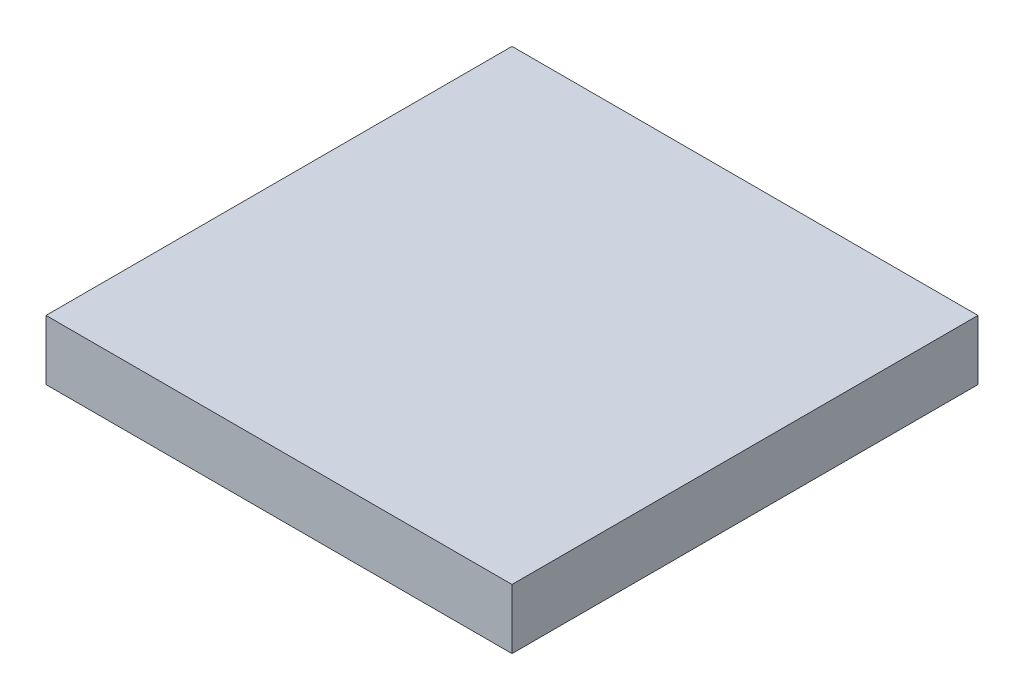
ISO-10303-21;
HEADER;
FILE_DESCRIPTION(('STEP AP214'),'2;1');
FILE_NAME('part.step','',(''),(''),'','','');
FILE_SCHEMA(('AUTOMOTIVE_DESIGN { 1 0 10303 214 1 1 1 1 }'));
ENDSEC;
DATA;
#1=APPLICATION_CONTEXT('core data for automotive mechanical design processes');
#2=APPLICATION_PROTOCOL_DEFINITION('international standard','automotive_design',2000,#1);
#3=PRODUCT_CONTEXT('',#1,'mechanical');
#4=PRODUCT('Part','Part','',(#3));
#5=PRODUCT_RELATED_PRODUCT_CATEGORY('part','',(#4));
#6=PRODUCT_DEFINITION_FORMATION('','',#4);
#7=PRODUCT_DEFINITION_CONTEXT('part definition',#1,'design');
#8=PRODUCT_DEFINITION('design','',#6,#7);
#9=PRODUCT_DEFINITION_SHAPE('','',#8);
#10=(LENGTH_UNIT() NAMED_UNIT(*) SI_UNIT(.MILLI.,.METRE.));
#11=(NAMED_UNIT(*) PLANE_ANGLE_UNIT() SI_UNIT($,.RADIAN.));
#12=(NAMED_UNIT(*) SI_UNIT($,.STERADIAN.) SOLID_ANGLE_UNIT());
#13=UNCERTAINTY_MEASURE_WITH_UNIT(LENGTH_MEASURE(1.E-05),#10,'distance_accuracy_value','');
#14=(GEOMETRIC_REPRESENTATION_CONTEXT(3) GLOBAL_UNCERTAINTY_ASSIGNED_CONTEXT((#13)) GLOBAL_UNIT_ASSIGNED_CONTEXT((#10,
#11,#12)) REPRESENTATION_CONTEXT('',''));
#15=CARTESIAN_POINT('',(0.,0.,0.));
#16=DIRECTION('',(0.,0.,1.));
#17=DIRECTION('',(1.,0.,0.));
#18=AXIS2_PLACEMENT_3D('',#15,#16,#17);
#19=CARTESIAN_POINT('',(3.5,0.9,-3.5));
#20=DIRECTION('',(-1.,0.,0.));
#21=DIRECTION('',(0.,0.,1.));
#22=AXIS2_PLACEMENT_3D('',#19,#20,#21);
#23=PLANE('',#22);
#24=DIRECTION('',(0.,0.,-1.));
#25=VECTOR('',#24,1.);
#26=CARTESIAN_POINT('',(3.5,0.,-3.5));
#27=LINE('',#26,#25);
#28=CARTESIAN_POINT('',(3.5,0.,3.5));
#29=VERTEX_POINT('',#28);
#30=CARTESIAN_POINT('',(3.5,0.,-3.5));
#31=VERTEX_POINT('',#30);
#32=EDGE_CURVE('E97',#29,#31,#27,.T.);
#33=ORIENTED_EDGE('',*,*,#32,.T.);
#34=DIRECTION('',(0.,-1.,0.));
#35=VECTOR('',#34,1.);
#36=CARTESIAN_POINT('',(3.5,0.9,-3.5));
#37=LINE('',#36,#35);
#38=CARTESIAN_POINT('',(3.5,0.9,-3.5));
#39=VERTEX_POINT('',#38);
#40=EDGE_CURVE('E11',#39,#31,#37,.T.);
#41=ORIENTED_EDGE('',*,*,#40,.F.);
#42=DIRECTION('',(0.,0.,-1.));
#43=VECTOR('',#42,1.);
#44=CARTESIAN_POINT('',(3.5,0.9,-3.5));
#45=LINE('',#44,#43);
#46=CARTESIAN_POINT('',(3.5,0.9,3.5));
#47=VERTEX_POINT('',#46);
#48=EDGE_CURVE('E85',#47,#39,#45,.T.);
#49=ORIENTED_EDGE('',*,*,#48,.F.);
#50=DIRECTION('',(0.,-1.,0.));
#51=VECTOR('',#50,1.);
#52=CARTESIAN_POINT('',(3.5,0.9,3.5));
#53=LINE('',#52,#51);
#54=EDGE_CURVE('E93',#47,#29,#53,.T.);
#55=ORIENTED_EDGE('',*,*,#54,.T.);
#56=EDGE_LOOP('',(#33,#41,#49,#55));
#57=FACE_BOUND('',#56,.T.);
#58=ADVANCED_FACE('F34',(#57),#23,.F.);
#59=CARTESIAN_POINT('',(-3.5,0.9,-3.5));
#60=DIRECTION('',(0.,0.,1.));
#61=DIRECTION('',(1.,0.,0.));
#62=AXIS2_PLACEMENT_3D('',#59,#60,#61);
#63=PLANE('',#62);
#64=DIRECTION('',(-1.,0.,0.));
#65=VECTOR('',#64,1.);
#66=CARTESIAN_POINT('',(-3.5,0.,-3.5));
#67=LINE('',#66,#65);
#68=CARTESIAN_POINT('',(-3.5,0.,-3.5));
#69=VERTEX_POINT('',#68);
#70=EDGE_CURVE('E89',#31,#69,#67,.T.);
#71=ORIENTED_EDGE('',*,*,#70,.T.);
#72=DIRECTION('',(0.,-1.,0.));
#73=VECTOR('',#72,1.);
#74=CARTESIAN_POINT('',(-3.5,0.9,-3.5));
#75=LINE('',#74,#73);
#76=CARTESIAN_POINT('',(-3.5,0.9,-3.5));
#77=VERTEX_POINT('',#76);
#78=EDGE_CURVE('E42',#77,#69,#75,.T.);
#79=ORIENTED_EDGE('',*,*,#78,.F.);
#80=DIRECTION('',(-1.,0.,0.));
#81=VECTOR('',#80,1.);
#82=CARTESIAN_POINT('',(-3.5,0.9,-3.5));
#83=LINE('',#82,#81);
#84=EDGE_CURVE('E80',#39,#77,#83,.T.);
#85=ORIENTED_EDGE('',*,*,#84,.F.);
#86=ORIENTED_EDGE('',*,*,#40,.T.);
#87=EDGE_LOOP('',(#71,#79,#85,#86));
#88=FACE_BOUND('',#87,.T.);
#89=ADVANCED_FACE('F88',(#88),#63,.F.);
#90=CARTESIAN_POINT('',(-3.5,0.9,-3.5));
#91=DIRECTION('',(1.,0.,0.));
#92=DIRECTION('',(0.,0.,-1.));
#93=AXIS2_PLACEMENT_3D('',#90,#91,#92);
#94=PLANE('',#93);
#95=DIRECTION('',(0.,0.,1.));
#96=VECTOR('',#95,1.);
#97=CARTESIAN_POINT('',(-3.5,0.,-3.5));
#98=LINE('',#97,#96);
#99=CARTESIAN_POINT('',(-3.5,0.,3.5));
#100=VERTEX_POINT('',#99);
#101=EDGE_CURVE('E67',#69,#100,#98,.T.);
#102=ORIENTED_EDGE('',*,*,#101,.T.);
#103=DIRECTION('',(0.,-1.,0.));
#104=VECTOR('',#103,1.);
#105=CARTESIAN_POINT('',(-3.5,0.9,3.5));
#106=LINE('',#105,#104);
#107=CARTESIAN_POINT('',(-3.5,0.9,3.5));
#108=VERTEX_POINT('',#107);
#109=EDGE_CURVE('E90',#108,#100,#106,.T.);
#110=ORIENTED_EDGE('',*,*,#109,.F.);
#111=DIRECTION('',(0.,0.,1.));
#112=VECTOR('',#111,1.);
#113=CARTESIAN_POINT('',(-3.5,0.9,-3.5));
#114=LINE('',#113,#112);
#115=EDGE_CURVE('E83',#77,#108,#114,.T.);
#116=ORIENTED_EDGE('',*,*,#115,.F.);
#117=ORIENTED_EDGE('',*,*,#78,.T.);
#118=EDGE_LOOP('',(#102,#110,#116,#117));
#119=FACE_BOUND('',#118,.T.);
#120=ADVANCED_FACE('F91',(#119),#94,.F.);
#121=CARTESIAN_POINT('',(-3.5,0.9,3.5));
#122=DIRECTION('',(0.,0.,-1.));
#123=DIRECTION('',(-1.,0.,0.));
#124=AXIS2_PLACEMENT_3D('',#121,#122,#123);
#125=PLANE('',#124);
#126=DIRECTION('',(1.,0.,0.));
#127=VECTOR('',#126,1.);
#128=CARTESIAN_POINT('',(-3.5,0.,3.5));
#129=LINE('',#128,#127);
#130=EDGE_CURVE('E73',#100,#29,#129,.T.);
#131=ORIENTED_EDGE('',*,*,#130,.T.);
#132=ORIENTED_EDGE('',*,*,#54,.F.);
#133=DIRECTION('',(1.,0.,0.));
#134=VECTOR('',#133,1.);
#135=CARTESIAN_POINT('',(-3.5,0.9,3.5));
#136=LINE('',#135,#134);
#137=EDGE_CURVE('E50',#108,#47,#136,.T.);
#138=ORIENTED_EDGE('',*,*,#137,.F.);
#139=ORIENTED_EDGE('',*,*,#109,.T.);
#140=EDGE_LOOP('',(#131,#132,#138,#139));
#141=FACE_BOUND('',#140,.T.);
#142=ADVANCED_FACE('F104',(#141),#125,.F.);
#143=CARTESIAN_POINT('',(0.,0.9,0.));
#144=DIRECTION('',(0.,1.,0.));
#145=DIRECTION('',(0.,0.,1.));
#146=AXIS2_PLACEMENT_3D('',#143,#144,#145);
#147=PLANE('',#146);
#148=ORIENTED_EDGE('',*,*,#48,.T.);
#149=ORIENTED_EDGE('',*,*,#84,.T.);
#150=ORIENTED_EDGE('',*,*,#115,.T.);
#151=ORIENTED_EDGE('',*,*,#137,.T.);
#152=EDGE_LOOP('',(#148,#149,#150,#151));
#153=FACE_BOUND('',#152,.T.);
#154=ADVANCED_FACE('F81',(#153),#147,.T.);
#155=CARTESIAN_POINT('',(0.,0.,0.));
#156=DIRECTION('',(0.,1.,0.));
#157=DIRECTION('',(0.,0.,1.));
#158=AXIS2_PLACEMENT_3D('',#155,#156,#157);
#159=PLANE('',#158);
#160=ORIENTED_EDGE('',*,*,#32,.F.);
#161=ORIENTED_EDGE('',*,*,#130,.F.);
#162=ORIENTED_EDGE('',*,*,#101,.F.);
#163=ORIENTED_EDGE('',*,*,#70,.F.);
#164=EDGE_LOOP('',(#160,#161,#162,#163));
#165=FACE_BOUND('',#164,.T.);
#166=ADVANCED_FACE('F107',(#165),#159,.F.);
#167=CLOSED_SHELL('',(#58,#89,#120,#142,#154,#166));
#168=MANIFOLD_SOLID_BREP('B2',#167);
#169=ADVANCED_BREP_SHAPE_REPRESENTATION('',(#18,#168),#14);
#170=SHAPE_DEFINITION_REPRESENTATION(#9,#169);
ENDSEC;
END-ISO-10303-21;
